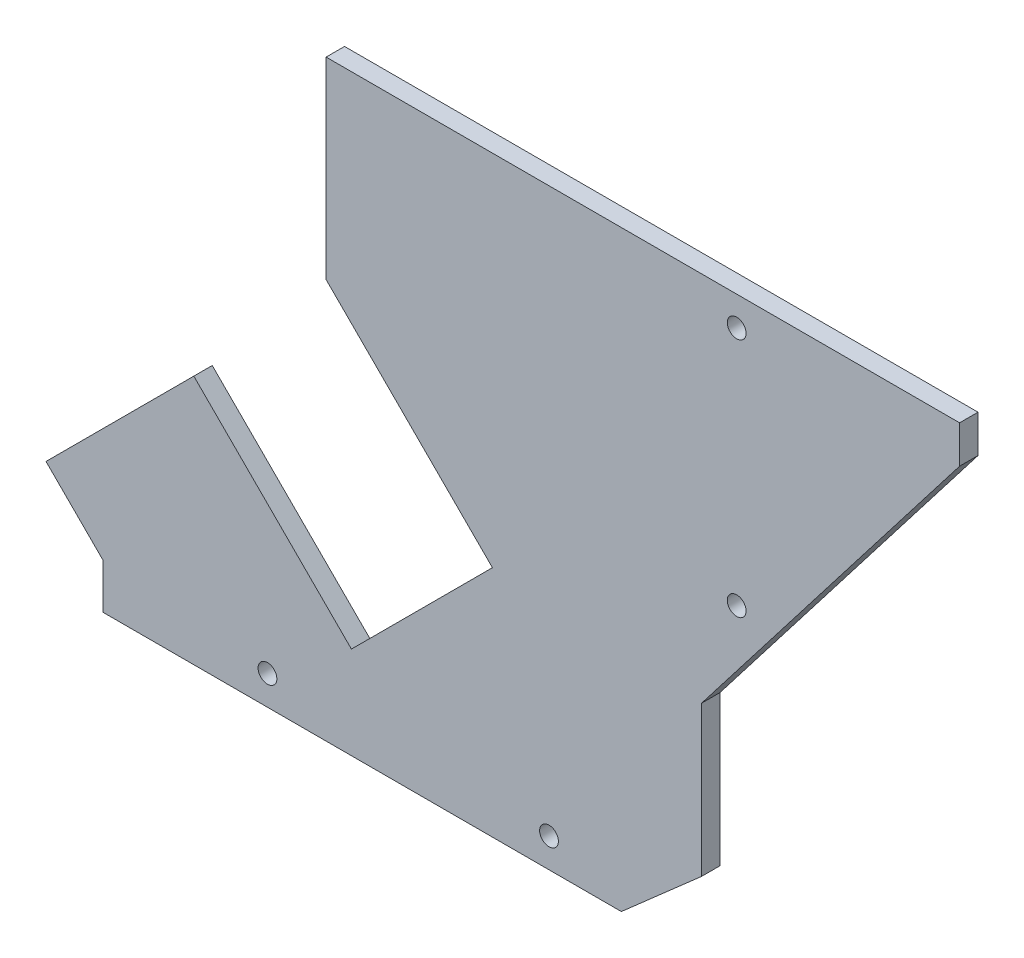
ISO-10303-21;
HEADER;
FILE_DESCRIPTION(('STEP AP214'),'2;1');
FILE_NAME('part.step','',(''),(''),'','','');
FILE_SCHEMA(('AUTOMOTIVE_DESIGN { 1 0 10303 214 1 1 1 1 }'));
ENDSEC;
DATA;
#1=APPLICATION_CONTEXT('core data for automotive mechanical design processes');
#2=APPLICATION_PROTOCOL_DEFINITION('international standard','automotive_design',2000,#1);
#3=PRODUCT_CONTEXT('',#1,'mechanical');
#4=PRODUCT('Part','Part','',(#3));
#5=PRODUCT_RELATED_PRODUCT_CATEGORY('part','',(#4));
#6=PRODUCT_DEFINITION_FORMATION('','',#4);
#7=PRODUCT_DEFINITION_CONTEXT('part definition',#1,'design');
#8=PRODUCT_DEFINITION('design','',#6,#7);
#9=PRODUCT_DEFINITION_SHAPE('','',#8);
#10=(LENGTH_UNIT() NAMED_UNIT(*) SI_UNIT(.MILLI.,.METRE.));
#11=(NAMED_UNIT(*) PLANE_ANGLE_UNIT() SI_UNIT($,.RADIAN.));
#12=(NAMED_UNIT(*) SI_UNIT($,.STERADIAN.) SOLID_ANGLE_UNIT());
#13=UNCERTAINTY_MEASURE_WITH_UNIT(LENGTH_MEASURE(1.E-05),#10,'distance_accuracy_value','');
#14=(GEOMETRIC_REPRESENTATION_CONTEXT(3) GLOBAL_UNCERTAINTY_ASSIGNED_CONTEXT((#13)) GLOBAL_UNIT_ASSIGNED_CONTEXT((#10,
#11,#12)) REPRESENTATION_CONTEXT('',''));
#15=CARTESIAN_POINT('',(0.,0.,0.));
#16=DIRECTION('',(0.,0.,1.));
#17=DIRECTION('',(1.,0.,0.));
#18=AXIS2_PLACEMENT_3D('',#15,#16,#17);
#19=CARTESIAN_POINT('',(5.,-5.00000000000141,1.57));
#20=DIRECTION('',(0.,-1.,0.));
#21=DIRECTION('',(0.,0.,-1.));
#22=AXIS2_PLACEMENT_3D('',#19,#20,#21);
#23=PLANE('',#22);
#24=DIRECTION('',(-1.,0.,0.));
#25=VECTOR('',#24,1.);
#26=CARTESIAN_POINT('',(5.,-5.00000000000141,0.));
#27=LINE('',#26,#25);
#28=CARTESIAN_POINT('',(58.9999999999858,-5.00000000000141,0.));
#29=VERTEX_POINT('',#28);
#30=CARTESIAN_POINT('',(5.,-5.00000000000141,0.));
#31=VERTEX_POINT('',#30);
#32=EDGE_CURVE('E159',#29,#31,#27,.T.);
#33=ORIENTED_EDGE('',*,*,#32,.T.);
#34=DIRECTION('',(0.,0.,-1.));
#35=VECTOR('',#34,1.);
#36=CARTESIAN_POINT('',(5.,-5.00000000000141,1.57));
#37=LINE('',#36,#35);
#38=CARTESIAN_POINT('',(5.,-5.00000000000141,1.57));
#39=VERTEX_POINT('',#38);
#40=EDGE_CURVE('E11',#39,#31,#37,.T.);
#41=ORIENTED_EDGE('',*,*,#40,.F.);
#42=DIRECTION('',(-1.,0.,0.));
#43=VECTOR('',#42,1.);
#44=CARTESIAN_POINT('',(5.,-5.00000000000141,1.57));
#45=LINE('',#44,#43);
#46=CARTESIAN_POINT('',(58.9999999999858,-5.00000000000141,1.57));
#47=VERTEX_POINT('',#46);
#48=EDGE_CURVE('E184',#47,#39,#45,.T.);
#49=ORIENTED_EDGE('',*,*,#48,.F.);
#50=DIRECTION('',(0.,0.,-1.));
#51=VECTOR('',#50,1.);
#52=CARTESIAN_POINT('',(58.9999999999858,-5.00000000000141,1.57));
#53=LINE('',#52,#51);
#54=EDGE_CURVE('E155',#47,#29,#53,.T.);
#55=ORIENTED_EDGE('',*,*,#54,.T.);
#56=EDGE_LOOP('',(#33,#41,#49,#55));
#57=FACE_BOUND('',#56,.T.);
#58=ADVANCED_FACE('F33',(#57),#23,.F.);
#59=CARTESIAN_POINT('',(5.,-5.00000000000141,1.57));
#60=DIRECTION('',(1.,0.,0.));
#61=DIRECTION('',(0.,0.,-1.));
#62=AXIS2_PLACEMENT_3D('',#59,#60,#61);
#63=PLANE('',#62);
#64=DIRECTION('',(0.,-1.,0.));
#65=VECTOR('',#64,1.);
#66=CARTESIAN_POINT('',(5.,-5.00000000000141,0.));
#67=LINE('',#66,#65);
#68=CARTESIAN_POINT('',(5.,-21.429035217227,0.));
#69=VERTEX_POINT('',#68);
#70=EDGE_CURVE('E162',#31,#69,#67,.T.);
#71=ORIENTED_EDGE('',*,*,#70,.T.);
#72=DIRECTION('',(0.,0.,-1.));
#73=VECTOR('',#72,1.);
#74=CARTESIAN_POINT('',(5.,-21.429035217227,1.57));
#75=LINE('',#74,#73);
#76=CARTESIAN_POINT('',(5.,-21.429035217227,1.57));
#77=VERTEX_POINT('',#76);
#78=EDGE_CURVE('E41',#77,#69,#75,.T.);
#79=ORIENTED_EDGE('',*,*,#78,.F.);
#80=DIRECTION('',(0.,-1.,0.));
#81=VECTOR('',#80,1.);
#82=CARTESIAN_POINT('',(5.,-5.00000000000141,1.57));
#83=LINE('',#82,#81);
#84=EDGE_CURVE('E107',#39,#77,#83,.T.);
#85=ORIENTED_EDGE('',*,*,#84,.F.);
#86=ORIENTED_EDGE('',*,*,#40,.T.);
#87=EDGE_LOOP('',(#71,#79,#85,#86));
#88=FACE_BOUND('',#87,.T.);
#89=ADVANCED_FACE('F269',(#88),#63,.F.);
#90=CARTESIAN_POINT('',(19.1776300450271,-35.6066652622541,1.57));
#91=DIRECTION('',(0.707106781186548,0.707106781186547,0.));
#92=DIRECTION('',(-0.707106781186547,0.707106781186548,0.));
#93=AXIS2_PLACEMENT_3D('',#90,#91,#92);
#94=PLANE('',#93);
#95=DIRECTION('',(0.707106781186547,-0.707106781186548,0.));
#96=VECTOR('',#95,1.);
#97=CARTESIAN_POINT('',(19.1776300450271,-35.6066652622541,0.));
#98=LINE('',#97,#96);
#99=CARTESIAN_POINT('',(19.1776300450271,-35.6066652622541,0.));
#100=VERTEX_POINT('',#99);
#101=EDGE_CURVE('E165',#69,#100,#98,.T.);
#102=ORIENTED_EDGE('',*,*,#101,.T.);
#103=DIRECTION('',(0.,0.,-1.));
#104=VECTOR('',#103,1.);
#105=CARTESIAN_POINT('',(19.1776300450271,-35.6066652622541,1.57));
#106=LINE('',#105,#104);
#107=CARTESIAN_POINT('',(19.1776300450271,-35.6066652622541,1.57));
#108=VERTEX_POINT('',#107);
#109=EDGE_CURVE('E206',#108,#100,#106,.T.);
#110=ORIENTED_EDGE('',*,*,#109,.F.);
#111=DIRECTION('',(0.707106781186547,-0.707106781186548,0.));
#112=VECTOR('',#111,1.);
#113=CARTESIAN_POINT('',(19.1776300450271,-35.6066652622541,1.57));
#114=LINE('',#113,#112);
#115=EDGE_CURVE('E214',#77,#108,#114,.T.);
#116=ORIENTED_EDGE('',*,*,#115,.F.);
#117=ORIENTED_EDGE('',*,*,#78,.T.);
#118=EDGE_LOOP('',(#102,#110,#116,#117));
#119=FACE_BOUND('',#118,.T.);
#120=ADVANCED_FACE('F212',(#119),#94,.F.);
#121=CARTESIAN_POINT('',(7.1568147648646,-47.6274805424167,1.57));
#122=DIRECTION('',(0.707106781186548,-0.707106781186547,0.));
#123=DIRECTION('',(0.707106781186547,0.707106781186548,0.));
#124=AXIS2_PLACEMENT_3D('',#121,#122,#123);
#125=PLANE('',#124);
#126=DIRECTION('',(-0.707106781186547,-0.707106781186548,0.));
#127=VECTOR('',#126,1.);
#128=CARTESIAN_POINT('',(7.1568147648646,-47.6274805424167,0.));
#129=LINE('',#128,#127);
#130=CARTESIAN_POINT('',(7.1568147648646,-47.6274805424167,0.));
#131=VERTEX_POINT('',#130);
#132=EDGE_CURVE('E167',#100,#131,#129,.T.);
#133=ORIENTED_EDGE('',*,*,#132,.T.);
#134=DIRECTION('',(0.,0.,-1.));
#135=VECTOR('',#134,1.);
#136=CARTESIAN_POINT('',(7.1568147648646,-47.6274805424167,1.57));
#137=LINE('',#136,#135);
#138=CARTESIAN_POINT('',(7.1568147648646,-47.6274805424167,1.57));
#139=VERTEX_POINT('',#138);
#140=EDGE_CURVE('E203',#139,#131,#137,.T.);
#141=ORIENTED_EDGE('',*,*,#140,.F.);
#142=DIRECTION('',(-0.707106781186547,-0.707106781186548,0.));
#143=VECTOR('',#142,1.);
#144=CARTESIAN_POINT('',(7.1568147648646,-47.6274805424167,1.57));
#145=LINE('',#144,#143);
#146=EDGE_CURVE('E232',#108,#139,#145,.T.);
#147=ORIENTED_EDGE('',*,*,#146,.F.);
#148=ORIENTED_EDGE('',*,*,#109,.T.);
#149=EDGE_LOOP('',(#133,#141,#147,#148));
#150=FACE_BOUND('',#149,.T.);
#151=ADVANCED_FACE('F223',(#150),#125,.F.);
#152=CARTESIAN_POINT('',(7.1568147648646,-47.6274805424167,1.57));
#153=DIRECTION('',(-0.707106781186547,-0.707106781186548,0.));
#154=DIRECTION('',(0.707106781186548,-0.707106781186547,0.));
#155=AXIS2_PLACEMENT_3D('',#152,#153,#154);
#156=PLANE('',#155);
#157=DIRECTION('',(-0.707106781186548,0.707106781186547,0.));
#158=VECTOR('',#157,1.);
#159=CARTESIAN_POINT('',(7.1568147648646,-47.6274805424167,0.));
#160=LINE('',#159,#158);
#161=CARTESIAN_POINT('',(-6.27821407767981,-34.1924516998723,0.));
#162=VERTEX_POINT('',#161);
#163=EDGE_CURVE('E169',#131,#162,#160,.T.);
#164=ORIENTED_EDGE('',*,*,#163,.T.);
#165=DIRECTION('',(0.,0.,-1.));
#166=VECTOR('',#165,1.);
#167=CARTESIAN_POINT('',(-6.27821407767981,-34.1924516998723,1.57));
#168=LINE('',#167,#166);
#169=CARTESIAN_POINT('',(-6.27821407767981,-34.1924516998723,1.57));
#170=VERTEX_POINT('',#169);
#171=EDGE_CURVE('E200',#170,#162,#168,.T.);
#172=ORIENTED_EDGE('',*,*,#171,.F.);
#173=DIRECTION('',(-0.707106781186548,0.707106781186547,0.));
#174=VECTOR('',#173,1.);
#175=CARTESIAN_POINT('',(7.1568147648646,-47.6274805424167,1.57));
#176=LINE('',#175,#174);
#177=EDGE_CURVE('E229',#139,#170,#176,.T.);
#178=ORIENTED_EDGE('',*,*,#177,.F.);
#179=ORIENTED_EDGE('',*,*,#140,.T.);
#180=EDGE_LOOP('',(#164,#172,#178,#179));
#181=FACE_BOUND('',#180,.T.);
#182=ADVANCED_FACE('F227',(#181),#156,.F.);
#183=CARTESIAN_POINT('',(-18.8786676271973,-46.7929052493898,1.57));
#184=DIRECTION('',(0.70710678118655,-0.707106781186545,0.));
#185=DIRECTION('',(0.707106781186545,0.70710678118655,0.));
#186=AXIS2_PLACEMENT_3D('',#183,#184,#185);
#187=PLANE('',#186);
#188=DIRECTION('',(-0.707106781186545,-0.70710678118655,0.));
#189=VECTOR('',#188,1.);
#190=CARTESIAN_POINT('',(-18.8786676271973,-46.7929052493898,0.));
#191=LINE('',#190,#189);
#192=CARTESIAN_POINT('',(-18.8786676271973,-46.7929052493898,0.));
#193=VERTEX_POINT('',#192);
#194=EDGE_CURVE('E171',#162,#193,#191,.T.);
#195=ORIENTED_EDGE('',*,*,#194,.T.);
#196=DIRECTION('',(0.,0.,-1.));
#197=VECTOR('',#196,1.);
#198=CARTESIAN_POINT('',(-18.8786676271973,-46.7929052493898,1.57));
#199=LINE('',#198,#197);
#200=CARTESIAN_POINT('',(-18.8786676271973,-46.7929052493898,1.57));
#201=VERTEX_POINT('',#200);
#202=EDGE_CURVE('E197',#201,#193,#199,.T.);
#203=ORIENTED_EDGE('',*,*,#202,.F.);
#204=DIRECTION('',(-0.707106781186545,-0.70710678118655,0.));
#205=VECTOR('',#204,1.);
#206=CARTESIAN_POINT('',(-18.8786676271973,-46.7929052493898,1.57));
#207=LINE('',#206,#205);
#208=EDGE_CURVE('E231',#170,#201,#207,.T.);
#209=ORIENTED_EDGE('',*,*,#208,.F.);
#210=ORIENTED_EDGE('',*,*,#171,.T.);
#211=EDGE_LOOP('',(#195,#203,#209,#210));
#212=FACE_BOUND('',#211,.T.);
#213=ADVANCED_FACE('F282',(#212),#187,.F.);
#214=CARTESIAN_POINT('',(-14.0000000000182,-51.67157287657,1.57));
#215=DIRECTION('',(0.707106781186628,0.707106781186468,0.));
#216=DIRECTION('',(-0.707106781186468,0.707106781186628,0.));
#217=AXIS2_PLACEMENT_3D('',#214,#215,#216);
#218=PLANE('',#217);
#219=DIRECTION('',(0.707106781186468,-0.707106781186628,0.));
#220=VECTOR('',#219,1.);
#221=CARTESIAN_POINT('',(-14.0000000000182,-51.67157287657,0.));
#222=LINE('',#221,#220);
#223=CARTESIAN_POINT('',(-14.0000000000182,-51.67157287657,0.));
#224=VERTEX_POINT('',#223);
#225=EDGE_CURVE('E173',#193,#224,#222,.T.);
#226=ORIENTED_EDGE('',*,*,#225,.T.);
#227=DIRECTION('',(0.,0.,-1.));
#228=VECTOR('',#227,1.);
#229=CARTESIAN_POINT('',(-14.0000000000182,-51.67157287657,1.57));
#230=LINE('',#229,#228);
#231=CARTESIAN_POINT('',(-14.0000000000182,-51.67157287657,1.57));
#232=VERTEX_POINT('',#231);
#233=EDGE_CURVE('E194',#232,#224,#230,.T.);
#234=ORIENTED_EDGE('',*,*,#233,.F.);
#235=DIRECTION('',(0.707106781186468,-0.707106781186628,0.));
#236=VECTOR('',#235,1.);
#237=CARTESIAN_POINT('',(-14.0000000000182,-51.67157287657,1.57));
#238=LINE('',#237,#236);
#239=EDGE_CURVE('E234',#201,#232,#238,.T.);
#240=ORIENTED_EDGE('',*,*,#239,.F.);
#241=ORIENTED_EDGE('',*,*,#202,.T.);
#242=EDGE_LOOP('',(#226,#234,#240,#241));
#243=FACE_BOUND('',#242,.T.);
#244=ADVANCED_FACE('F285',(#243),#218,.F.);
#245=CARTESIAN_POINT('',(-14.0000000000182,-55.5001030290793,1.57));
#246=DIRECTION('',(1.,0.,0.));
#247=DIRECTION('',(0.,0.,-1.));
#248=AXIS2_PLACEMENT_3D('',#245,#246,#247);
#249=PLANE('',#248);
#250=DIRECTION('',(0.,-1.,0.));
#251=VECTOR('',#250,1.);
#252=CARTESIAN_POINT('',(-14.0000000000182,-55.5001030290793,0.));
#253=LINE('',#252,#251);
#254=CARTESIAN_POINT('',(-14.0000000000182,-55.5001030290793,0.));
#255=VERTEX_POINT('',#254);
#256=EDGE_CURVE('E175',#224,#255,#253,.T.);
#257=ORIENTED_EDGE('',*,*,#256,.T.);
#258=DIRECTION('',(0.,0.,-1.));
#259=VECTOR('',#258,1.);
#260=CARTESIAN_POINT('',(-14.0000000000182,-55.5001030290793,1.57));
#261=LINE('',#260,#259);
#262=CARTESIAN_POINT('',(-14.0000000000182,-55.5001030290793,1.57));
#263=VERTEX_POINT('',#262);
#264=EDGE_CURVE('E191',#263,#255,#261,.T.);
#265=ORIENTED_EDGE('',*,*,#264,.F.);
#266=DIRECTION('',(0.,-1.,0.));
#267=VECTOR('',#266,1.);
#268=CARTESIAN_POINT('',(-14.0000000000182,-55.5001030290793,1.57));
#269=LINE('',#268,#267);
#270=EDGE_CURVE('E240',#232,#263,#269,.T.);
#271=ORIENTED_EDGE('',*,*,#270,.F.);
#272=ORIENTED_EDGE('',*,*,#233,.T.);
#273=EDGE_LOOP('',(#257,#265,#271,#272));
#274=FACE_BOUND('',#273,.T.);
#275=ADVANCED_FACE('F289',(#274),#249,.F.);
#276=CARTESIAN_POINT('',(-14.0000000000182,-55.5001030290793,1.57));
#277=DIRECTION('',(0.,1.,0.));
#278=DIRECTION('',(0.,0.,1.));
#279=AXIS2_PLACEMENT_3D('',#276,#277,#278);
#280=PLANE('',#279);
#281=DIRECTION('',(1.,0.,0.));
#282=VECTOR('',#281,1.);
#283=CARTESIAN_POINT('',(-14.0000000000182,-55.5001030290793,0.));
#284=LINE('',#283,#282);
#285=CARTESIAN_POINT('',(30.1655620868197,-55.5001030290793,0.));
#286=VERTEX_POINT('',#285);
#287=EDGE_CURVE('E177',#255,#286,#284,.T.);
#288=ORIENTED_EDGE('',*,*,#287,.T.);
#289=DIRECTION('',(0.,0.,-1.));
#290=VECTOR('',#289,1.);
#291=CARTESIAN_POINT('',(30.1655620868197,-55.5001030290793,1.57));
#292=LINE('',#291,#290);
#293=CARTESIAN_POINT('',(30.1655620868197,-55.5001030290793,1.57));
#294=VERTEX_POINT('',#293);
#295=EDGE_CURVE('E188',#294,#286,#292,.T.);
#296=ORIENTED_EDGE('',*,*,#295,.F.);
#297=DIRECTION('',(1.,0.,0.));
#298=VECTOR('',#297,1.);
#299=CARTESIAN_POINT('',(-14.0000000000182,-55.5001030290793,1.57));
#300=LINE('',#299,#298);
#301=EDGE_CURVE('E242',#263,#294,#300,.T.);
#302=ORIENTED_EDGE('',*,*,#301,.F.);
#303=ORIENTED_EDGE('',*,*,#264,.T.);
#304=EDGE_LOOP('',(#288,#296,#302,#303));
#305=FACE_BOUND('',#304,.T.);
#306=ADVANCED_FACE('F248',(#305),#280,.F.);
#307=CARTESIAN_POINT('',(30.1655620868197,-55.5001030290793,1.57));
#308=DIRECTION('',(-0.660254994341223,0.751041505143006,0.));
#309=DIRECTION('',(-0.751041505143006,-0.660254994341223,0.));
#310=AXIS2_PLACEMENT_3D('',#307,#308,#309);
#311=PLANE('',#310);
#312=DIRECTION('',(0.751041505143006,0.660254994341222,0.));
#313=VECTOR('',#312,1.);
#314=CARTESIAN_POINT('',(30.1655620868197,-55.5001030290793,0.));
#315=LINE('',#314,#313);
#316=CARTESIAN_POINT('',(37.0000000008633,-49.4918175543597,0.));
#317=VERTEX_POINT('',#316);
#318=EDGE_CURVE('E179',#286,#317,#315,.T.);
#319=ORIENTED_EDGE('',*,*,#318,.T.);
#320=DIRECTION('',(0.,0.,-1.));
#321=VECTOR('',#320,1.);
#322=CARTESIAN_POINT('',(37.0000000008633,-49.4918175543597,1.57));
#323=LINE('',#322,#321);
#324=CARTESIAN_POINT('',(37.0000000008633,-49.4918175543597,1.57));
#325=VERTEX_POINT('',#324);
#326=EDGE_CURVE('E150',#325,#317,#323,.T.);
#327=ORIENTED_EDGE('',*,*,#326,.F.);
#328=DIRECTION('',(0.751041505143006,0.660254994341222,0.));
#329=VECTOR('',#328,1.);
#330=CARTESIAN_POINT('',(30.1655620868197,-55.5001030290793,1.57));
#331=LINE('',#330,#329);
#332=EDGE_CURVE('E141',#294,#325,#331,.T.);
#333=ORIENTED_EDGE('',*,*,#332,.F.);
#334=ORIENTED_EDGE('',*,*,#295,.T.);
#335=EDGE_LOOP('',(#319,#327,#333,#334));
#336=FACE_BOUND('',#335,.T.);
#337=ADVANCED_FACE('F252',(#336),#311,.F.);
#338=CARTESIAN_POINT('',(37.0000000008627,-36.704229807817,1.57));
#339=DIRECTION('',(-1.,0.,0.));
#340=DIRECTION('',(0.,-1.,0.));
#341=AXIS2_PLACEMENT_3D('',#338,#339,#340);
#342=PLANE('',#341);
#343=DIRECTION('',(0.,1.,0.));
#344=VECTOR('',#343,1.);
#345=CARTESIAN_POINT('',(37.0000000008627,-36.704229807817,0.));
#346=LINE('',#345,#344);
#347=CARTESIAN_POINT('',(37.0000000008627,-36.704229807817,0.));
#348=VERTEX_POINT('',#347);
#349=EDGE_CURVE('E149',#317,#348,#346,.T.);
#350=ORIENTED_EDGE('',*,*,#349,.T.);
#351=DIRECTION('',(0.,0.,-1.));
#352=VECTOR('',#351,1.);
#353=CARTESIAN_POINT('',(37.0000000008627,-36.704229807817,1.57));
#354=LINE('',#353,#352);
#355=CARTESIAN_POINT('',(37.0000000008627,-36.704229807817,1.57));
#356=VERTEX_POINT('',#355);
#357=EDGE_CURVE('E146',#356,#348,#354,.T.);
#358=ORIENTED_EDGE('',*,*,#357,.F.);
#359=DIRECTION('',(0.,1.,0.));
#360=VECTOR('',#359,1.);
#361=CARTESIAN_POINT('',(37.0000000008627,-36.704229807817,1.57));
#362=LINE('',#361,#360);
#363=EDGE_CURVE('E135',#325,#356,#362,.T.);
#364=ORIENTED_EDGE('',*,*,#363,.F.);
#365=ORIENTED_EDGE('',*,*,#326,.T.);
#366=EDGE_LOOP('',(#350,#358,#364,#365));
#367=FACE_BOUND('',#366,.T.);
#368=ADVANCED_FACE('F147',(#367),#342,.F.);
#369=CARTESIAN_POINT('',(58.9999999999858,-8.20422980893115,1.57));
#370=DIRECTION('',(-0.791590320973416,0.611052177593046,0.));
#371=DIRECTION('',(-0.611052177593046,-0.791590320973416,0.));
#372=AXIS2_PLACEMENT_3D('',#369,#370,#371);
#373=PLANE('',#372);
#374=DIRECTION('',(0.611052177593046,0.791590320973416,0.));
#375=VECTOR('',#374,1.);
#376=CARTESIAN_POINT('',(58.9999999999858,-8.20422980893115,0.));
#377=LINE('',#376,#375);
#378=CARTESIAN_POINT('',(58.9999999999858,-8.20422980893115,0.));
#379=VERTEX_POINT('',#378);
#380=EDGE_CURVE('E93',#348,#379,#377,.T.);
#381=ORIENTED_EDGE('',*,*,#380,.T.);
#382=DIRECTION('',(0.,0.,-1.));
#383=VECTOR('',#382,1.);
#384=CARTESIAN_POINT('',(58.9999999999858,-8.20422980893115,1.57));
#385=LINE('',#384,#383);
#386=CARTESIAN_POINT('',(58.9999999999858,-8.20422980893115,1.57));
#387=VERTEX_POINT('',#386);
#388=EDGE_CURVE('E151',#387,#379,#385,.T.);
#389=ORIENTED_EDGE('',*,*,#388,.F.);
#390=DIRECTION('',(0.611052177593046,0.791590320973416,0.));
#391=VECTOR('',#390,1.);
#392=CARTESIAN_POINT('',(58.9999999999858,-8.20422980893115,1.57));
#393=LINE('',#392,#391);
#394=EDGE_CURVE('E139',#356,#387,#393,.T.);
#395=ORIENTED_EDGE('',*,*,#394,.F.);
#396=ORIENTED_EDGE('',*,*,#357,.T.);
#397=EDGE_LOOP('',(#381,#389,#395,#396));
#398=FACE_BOUND('',#397,.T.);
#399=ADVANCED_FACE('F153',(#398),#373,.F.);
#400=CARTESIAN_POINT('',(58.9999999999858,-8.20422980893115,1.57));
#401=DIRECTION('',(-1.,0.,0.));
#402=DIRECTION('',(0.,0.,1.));
#403=AXIS2_PLACEMENT_3D('',#400,#401,#402);
#404=PLANE('',#403);
#405=DIRECTION('',(0.,1.,0.));
#406=VECTOR('',#405,1.);
#407=CARTESIAN_POINT('',(58.9999999999858,-8.20422980893115,0.));
#408=LINE('',#407,#406);
#409=EDGE_CURVE('E99',#379,#29,#408,.T.);
#410=ORIENTED_EDGE('',*,*,#409,.T.);
#411=ORIENTED_EDGE('',*,*,#54,.F.);
#412=DIRECTION('',(0.,1.,0.));
#413=VECTOR('',#412,1.);
#414=CARTESIAN_POINT('',(58.9999999999858,-8.20422980893115,1.57));
#415=LINE('',#414,#413);
#416=EDGE_CURVE('E49',#387,#47,#415,.T.);
#417=ORIENTED_EDGE('',*,*,#416,.F.);
#418=ORIENTED_EDGE('',*,*,#388,.T.);
#419=EDGE_LOOP('',(#410,#411,#417,#418));
#420=FACE_BOUND('',#419,.T.);
#421=ADVANCED_FACE('F256',(#420),#404,.F.);
#422=CARTESIAN_POINT('',(0.,0.,1.57));
#423=DIRECTION('',(0.,0.,1.));
#424=DIRECTION('',(1.,0.,0.));
#425=AXIS2_PLACEMENT_3D('',#422,#423,#424);
#426=PLANE('',#425);
#427=CARTESIAN_POINT('',(24.000063680747,-52.9999914808726,1.57));
#428=DIRECTION('',(0.,0.,1.));
#429=DIRECTION('',(1.,0.,0.));
#430=AXIS2_PLACEMENT_3D('',#427,#428,#429);
#431=CIRCLE('',#430,0.8);
#432=CARTESIAN_POINT('',(24.800063680747,-52.9999914808726,1.57));
#433=VERTEX_POINT('',#432);
#434=EDGE_CURVE('E370',#433,#433,#431,.T.);
#435=ORIENTED_EDGE('',*,*,#434,.F.);
#436=EDGE_LOOP('',(#435));
#437=FACE_BOUND('',#436,.T.);
#438=CARTESIAN_POINT('',(39.9998981074124,-27.9998855160343,1.57));
#439=DIRECTION('',(0.,0.,1.));
#440=DIRECTION('',(1.,0.,0.));
#441=AXIS2_PLACEMENT_3D('',#438,#439,#440);
#442=CIRCLE('',#441,0.800000000000003);
#443=CARTESIAN_POINT('',(40.7998981074124,-27.9998855160343,1.57));
#444=VERTEX_POINT('',#443);
#445=EDGE_CURVE('E372',#444,#444,#442,.T.);
#446=ORIENTED_EDGE('',*,*,#445,.F.);
#447=EDGE_LOOP('',(#446));
#448=FACE_BOUND('',#447,.T.);
#449=CARTESIAN_POINT('',(6.36807469950318E-05,-52.9999914808726,1.57));
#450=DIRECTION('',(0.,0.,1.));
#451=DIRECTION('',(1.,0.,0.));
#452=AXIS2_PLACEMENT_3D('',#449,#450,#451);
#453=CIRCLE('',#452,0.800000000000002);
#454=CARTESIAN_POINT('',(0.800063680746997,-52.9999914808726,1.57));
#455=VERTEX_POINT('',#454);
#456=EDGE_CURVE('E378',#455,#455,#453,.T.);
#457=ORIENTED_EDGE('',*,*,#456,.F.);
#458=EDGE_LOOP('',(#457));
#459=FACE_BOUND('',#458,.T.);
#460=CARTESIAN_POINT('',(39.9997987636234,-7.50000000000141,1.57));
#461=DIRECTION('',(0.,0.,1.));
#462=DIRECTION('',(1.,0.,0.));
#463=AXIS2_PLACEMENT_3D('',#460,#461,#462);
#464=CIRCLE('',#463,0.800000000000002);
#465=CARTESIAN_POINT('',(40.7997987636234,-7.50000000000141,1.57));
#466=VERTEX_POINT('',#465);
#467=EDGE_CURVE('E384',#466,#466,#464,.T.);
#468=ORIENTED_EDGE('',*,*,#467,.F.);
#469=EDGE_LOOP('',(#468));
#470=FACE_BOUND('',#469,.T.);
#471=ORIENTED_EDGE('',*,*,#48,.T.);
#472=ORIENTED_EDGE('',*,*,#84,.T.);
#473=ORIENTED_EDGE('',*,*,#115,.T.);
#474=ORIENTED_EDGE('',*,*,#146,.T.);
#475=ORIENTED_EDGE('',*,*,#177,.T.);
#476=ORIENTED_EDGE('',*,*,#208,.T.);
#477=ORIENTED_EDGE('',*,*,#239,.T.);
#478=ORIENTED_EDGE('',*,*,#270,.T.);
#479=ORIENTED_EDGE('',*,*,#301,.T.);
#480=ORIENTED_EDGE('',*,*,#332,.T.);
#481=ORIENTED_EDGE('',*,*,#363,.T.);
#482=ORIENTED_EDGE('',*,*,#394,.T.);
#483=ORIENTED_EDGE('',*,*,#416,.T.);
#484=EDGE_LOOP('',(#471,#472,#473,#474,#475,#476,#477,#478,#479,#480,#481,#482,#483));
#485=FACE_BOUND('',#484,.T.);
#486=ADVANCED_FACE('F137',(#437,#448,#459,#470,#485),#426,.T.);
#487=CARTESIAN_POINT('',(0.,0.,0.));
#488=DIRECTION('',(0.,0.,1.));
#489=DIRECTION('',(1.,0.,0.));
#490=AXIS2_PLACEMENT_3D('',#487,#488,#489);
#491=PLANE('',#490);
#492=CARTESIAN_POINT('',(24.000063680747,-52.9999914808726,0.));
#493=DIRECTION('',(0.,0.,1.));
#494=DIRECTION('',(1.,0.,0.));
#495=AXIS2_PLACEMENT_3D('',#492,#493,#494);
#496=CIRCLE('',#495,0.8);
#497=CARTESIAN_POINT('',(24.800063680747,-52.9999914808726,0.));
#498=VERTEX_POINT('',#497);
#499=EDGE_CURVE('E367',#498,#498,#496,.T.);
#500=ORIENTED_EDGE('',*,*,#499,.T.);
#501=EDGE_LOOP('',(#500));
#502=FACE_BOUND('',#501,.T.);
#503=CARTESIAN_POINT('',(39.9998981074124,-27.9998855160343,0.));
#504=DIRECTION('',(0.,0.,1.));
#505=DIRECTION('',(1.,0.,0.));
#506=AXIS2_PLACEMENT_3D('',#503,#504,#505);
#507=CIRCLE('',#506,0.800000000000003);
#508=CARTESIAN_POINT('',(40.7998981074124,-27.9998855160343,0.));
#509=VERTEX_POINT('',#508);
#510=EDGE_CURVE('E375',#509,#509,#507,.T.);
#511=ORIENTED_EDGE('',*,*,#510,.T.);
#512=EDGE_LOOP('',(#511));
#513=FACE_BOUND('',#512,.T.);
#514=CARTESIAN_POINT('',(6.36807469950318E-05,-52.9999914808726,0.));
#515=DIRECTION('',(0.,0.,1.));
#516=DIRECTION('',(1.,0.,0.));
#517=AXIS2_PLACEMENT_3D('',#514,#515,#516);
#518=CIRCLE('',#517,0.800000000000002);
#519=CARTESIAN_POINT('',(0.800063680746997,-52.9999914808726,0.));
#520=VERTEX_POINT('',#519);
#521=EDGE_CURVE('E381',#520,#520,#518,.T.);
#522=ORIENTED_EDGE('',*,*,#521,.T.);
#523=EDGE_LOOP('',(#522));
#524=FACE_BOUND('',#523,.T.);
#525=CARTESIAN_POINT('',(39.9997987636234,-7.50000000000141,0.));
#526=DIRECTION('',(0.,0.,1.));
#527=DIRECTION('',(1.,0.,0.));
#528=AXIS2_PLACEMENT_3D('',#525,#526,#527);
#529=CIRCLE('',#528,0.800000000000002);
#530=CARTESIAN_POINT('',(40.7997987636234,-7.50000000000141,0.));
#531=VERTEX_POINT('',#530);
#532=EDGE_CURVE('E163',#531,#531,#529,.T.);
#533=ORIENTED_EDGE('',*,*,#532,.T.);
#534=EDGE_LOOP('',(#533));
#535=FACE_BOUND('',#534,.T.);
#536=ORIENTED_EDGE('',*,*,#32,.F.);
#537=ORIENTED_EDGE('',*,*,#409,.F.);
#538=ORIENTED_EDGE('',*,*,#380,.F.);
#539=ORIENTED_EDGE('',*,*,#349,.F.);
#540=ORIENTED_EDGE('',*,*,#318,.F.);
#541=ORIENTED_EDGE('',*,*,#287,.F.);
#542=ORIENTED_EDGE('',*,*,#256,.F.);
#543=ORIENTED_EDGE('',*,*,#225,.F.);
#544=ORIENTED_EDGE('',*,*,#194,.F.);
#545=ORIENTED_EDGE('',*,*,#163,.F.);
#546=ORIENTED_EDGE('',*,*,#132,.F.);
#547=ORIENTED_EDGE('',*,*,#101,.F.);
#548=ORIENTED_EDGE('',*,*,#70,.F.);
#549=EDGE_LOOP('',(#536,#537,#538,#539,#540,#541,#542,#543,#544,#545,#546,#547,#548));
#550=FACE_BOUND('',#549,.T.);
#551=ADVANCED_FACE('F218',(#502,#513,#524,#535,#550),#491,.F.);
#552=CARTESIAN_POINT('',(39.9997987636234,-7.50000000000141,0.));
#553=DIRECTION('',(0.,0.,1.));
#554=DIRECTION('',(1.,0.,0.));
#555=AXIS2_PLACEMENT_3D('',#552,#553,#554);
#556=CYLINDRICAL_SURFACE('',#555,0.800000000000002);
#557=ORIENTED_EDGE('',*,*,#532,.F.);
#558=EDGE_LOOP('',(#557));
#559=FACE_BOUND('',#558,.T.);
#560=ORIENTED_EDGE('',*,*,#467,.T.);
#561=EDGE_LOOP('',(#560));
#562=FACE_BOUND('',#561,.T.);
#563=ADVANCED_FACE('F322',(#559,#562),#556,.F.);
#564=CARTESIAN_POINT('',(6.36807469950318E-05,-52.9999914808726,0.));
#565=DIRECTION('',(0.,0.,1.));
#566=DIRECTION('',(1.,0.,0.));
#567=AXIS2_PLACEMENT_3D('',#564,#565,#566);
#568=CYLINDRICAL_SURFACE('',#567,0.800000000000002);
#569=ORIENTED_EDGE('',*,*,#521,.F.);
#570=EDGE_LOOP('',(#569));
#571=FACE_BOUND('',#570,.T.);
#572=ORIENTED_EDGE('',*,*,#456,.T.);
#573=EDGE_LOOP('',(#572));
#574=FACE_BOUND('',#573,.T.);
#575=ADVANCED_FACE('F330',(#571,#574),#568,.F.);
#576=CARTESIAN_POINT('',(39.9998981074124,-27.9998855160343,0.));
#577=DIRECTION('',(0.,0.,1.));
#578=DIRECTION('',(1.,0.,0.));
#579=AXIS2_PLACEMENT_3D('',#576,#577,#578);
#580=CYLINDRICAL_SURFACE('',#579,0.800000000000003);
#581=ORIENTED_EDGE('',*,*,#510,.F.);
#582=EDGE_LOOP('',(#581));
#583=FACE_BOUND('',#582,.T.);
#584=ORIENTED_EDGE('',*,*,#445,.T.);
#585=EDGE_LOOP('',(#584));
#586=FACE_BOUND('',#585,.T.);
#587=ADVANCED_FACE('F340',(#583,#586),#580,.F.);
#588=CARTESIAN_POINT('',(24.000063680747,-52.9999914808726,0.));
#589=DIRECTION('',(0.,0.,1.));
#590=DIRECTION('',(1.,0.,0.));
#591=AXIS2_PLACEMENT_3D('',#588,#589,#590);
#592=CYLINDRICAL_SURFACE('',#591,0.8);
#593=ORIENTED_EDGE('',*,*,#499,.F.);
#594=EDGE_LOOP('',(#593));
#595=FACE_BOUND('',#594,.T.);
#596=ORIENTED_EDGE('',*,*,#434,.T.);
#597=EDGE_LOOP('',(#596));
#598=FACE_BOUND('',#597,.T.);
#599=ADVANCED_FACE('F350',(#595,#598),#592,.F.);
#600=CLOSED_SHELL('',(#58,#89,#120,#151,#182,#213,#244,#275,#306,#337,#368,#399,#421,#486,#551,
#563,#575,#587,#599));
#601=MANIFOLD_SOLID_BREP('B2',#600);
#602=ADVANCED_BREP_SHAPE_REPRESENTATION('',(#18,#601),#14);
#603=SHAPE_DEFINITION_REPRESENTATION(#9,#602);
ENDSEC;
END-ISO-10303-21;
